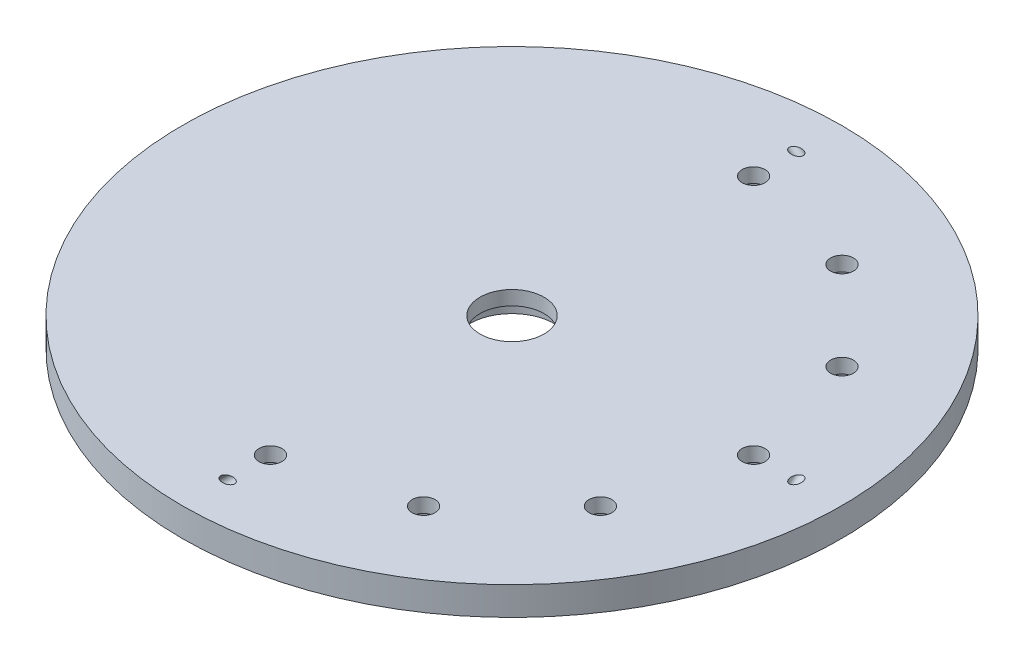
ISO-10303-21;
HEADER;
FILE_DESCRIPTION(('STEP AP214'),'2;1');
FILE_NAME('part.step','',(''),(''),'','','');
FILE_SCHEMA(('AUTOMOTIVE_DESIGN { 1 0 10303 214 1 1 1 1 }'));
ENDSEC;
DATA;
#1=APPLICATION_CONTEXT('core data for automotive mechanical design processes');
#2=APPLICATION_PROTOCOL_DEFINITION('international standard','automotive_design',2000,#1);
#3=PRODUCT_CONTEXT('',#1,'mechanical');
#4=PRODUCT('Part','Part','',(#3));
#5=PRODUCT_RELATED_PRODUCT_CATEGORY('part','',(#4));
#6=PRODUCT_DEFINITION_FORMATION('','',#4);
#7=PRODUCT_DEFINITION_CONTEXT('part definition',#1,'design');
#8=PRODUCT_DEFINITION('design','',#6,#7);
#9=PRODUCT_DEFINITION_SHAPE('','',#8);
#10=(LENGTH_UNIT() NAMED_UNIT(*) SI_UNIT(.MILLI.,.METRE.));
#11=(NAMED_UNIT(*) PLANE_ANGLE_UNIT() SI_UNIT($,.RADIAN.));
#12=(NAMED_UNIT(*) SI_UNIT($,.STERADIAN.) SOLID_ANGLE_UNIT());
#13=UNCERTAINTY_MEASURE_WITH_UNIT(LENGTH_MEASURE(1.E-05),#10,'distance_accuracy_value','');
#14=(GEOMETRIC_REPRESENTATION_CONTEXT(3) GLOBAL_UNCERTAINTY_ASSIGNED_CONTEXT((#13)) GLOBAL_UNIT_ASSIGNED_CONTEXT((#10,
#11,#12)) REPRESENTATION_CONTEXT('',''));
#15=CARTESIAN_POINT('',(0.,0.,0.));
#16=DIRECTION('',(0.,0.,1.));
#17=DIRECTION('',(1.,0.,0.));
#18=AXIS2_PLACEMENT_3D('',#15,#16,#17);
#19=CARTESIAN_POINT('',(0.,0.,0.));
#20=DIRECTION('',(0.,1.,0.));
#21=DIRECTION('',(0.,0.,1.));
#22=AXIS2_PLACEMENT_3D('',#19,#20,#21);
#23=PLANE('',#22);
#24=CARTESIAN_POINT('',(46.7437211692654,0.,-26.9874999999994));
#25=DIRECTION('',(0.,-1.,0.));
#26=DIRECTION('',(0.,0.,-1.));
#27=AXIS2_PLACEMENT_3D('',#24,#25,#26);
#28=CIRCLE('',#27,5.55624999999999);
#29=CARTESIAN_POINT('',(46.7437211692654,0.,-32.5437499999994));
#30=VERTEX_POINT('',#29);
#31=EDGE_CURVE('E600',#30,#30,#28,.T.);
#32=ORIENTED_EDGE('',*,*,#31,.F.);
#33=EDGE_LOOP('',(#32));
#34=FACE_BOUND('',#33,.T.);
#35=CARTESIAN_POINT('',(26.9875000000005,0.,-46.7437211692648));
#36=DIRECTION('',(0.,-1.,0.));
#37=DIRECTION('',(0.,0.,-1.));
#38=AXIS2_PLACEMENT_3D('',#35,#36,#37);
#39=CIRCLE('',#38,5.55625);
#40=CARTESIAN_POINT('',(26.9875000000005,0.,-52.2999711692648));
#41=VERTEX_POINT('',#40);
#42=EDGE_CURVE('E116',#41,#41,#39,.T.);
#43=ORIENTED_EDGE('',*,*,#42,.F.);
#44=EDGE_LOOP('',(#43));
#45=FACE_BOUND('',#44,.T.);
#46=CARTESIAN_POINT('',(-1.88452705264058E-13,0.,53.975));
#47=DIRECTION('',(0.,-1.,0.));
#48=DIRECTION('',(0.,0.,-1.));
#49=AXIS2_PLACEMENT_3D('',#46,#47,#48);
#50=CIRCLE('',#49,5.55625);
#51=CARTESIAN_POINT('',(-1.88452705264058E-13,0.,48.41875));
#52=VERTEX_POINT('',#51);
#53=EDGE_CURVE('E99',#52,#52,#50,.T.);
#54=ORIENTED_EDGE('',*,*,#53,.F.);
#55=EDGE_LOOP('',(#54));
#56=FACE_BOUND('',#55,.T.);
#57=CARTESIAN_POINT('',(26.9874999999999,0.,46.7437211692651));
#58=DIRECTION('',(0.,-1.,0.));
#59=DIRECTION('',(0.,0.,-1.));
#60=AXIS2_PLACEMENT_3D('',#57,#58,#59);
#61=CIRCLE('',#60,5.55625);
#62=CARTESIAN_POINT('',(26.9874999999999,0.,41.1874711692651));
#63=VERTEX_POINT('',#62);
#64=EDGE_CURVE('E95',#63,#63,#61,.T.);
#65=ORIENTED_EDGE('',*,*,#64,.F.);
#66=EDGE_LOOP('',(#65));
#67=FACE_BOUND('',#66,.T.);
#68=CARTESIAN_POINT('',(46.743721169265,0.,26.9875000000001));
#69=DIRECTION('',(0.,-1.,0.));
#70=DIRECTION('',(0.,0.,-1.));
#71=AXIS2_PLACEMENT_3D('',#68,#69,#70);
#72=CIRCLE('',#71,5.55624999999999);
#73=CARTESIAN_POINT('',(46.743721169265,0.,21.4312500000001));
#74=VERTEX_POINT('',#73);
#75=EDGE_CURVE('E90',#74,#74,#72,.T.);
#76=ORIENTED_EDGE('',*,*,#75,.F.);
#77=EDGE_LOOP('',(#76));
#78=FACE_BOUND('',#77,.T.);
#79=CARTESIAN_POINT('',(53.975,0.,0.));
#80=DIRECTION('',(0.,-1.,0.));
#81=DIRECTION('',(0.,0.,-1.));
#82=AXIS2_PLACEMENT_3D('',#79,#80,#81);
#83=CIRCLE('',#82,5.55625);
#84=CARTESIAN_POINT('',(53.975,0.,-5.55625));
#85=VERTEX_POINT('',#84);
#86=EDGE_CURVE('E85',#85,#85,#83,.T.);
#87=ORIENTED_EDGE('',*,*,#86,.F.);
#88=EDGE_LOOP('',(#87));
#89=FACE_BOUND('',#88,.T.);
#90=CARTESIAN_POINT('',(0.,0.,0.));
#91=DIRECTION('',(0.,1.,0.));
#92=DIRECTION('',(0.,0.,1.));
#93=AXIS2_PLACEMENT_3D('',#90,#91,#92);
#94=CIRCLE('',#93,9.525);
#95=CARTESIAN_POINT('',(0.,0.,9.525));
#96=VERTEX_POINT('',#95);
#97=EDGE_CURVE('E80',#96,#96,#94,.T.);
#98=ORIENTED_EDGE('',*,*,#97,.T.);
#99=EDGE_LOOP('',(#98));
#100=FACE_BOUND('',#99,.T.);
#101=CARTESIAN_POINT('',(-7.39566734064749,0.,63.53048));
#102=DIRECTION('',(0.,1.,0.));
#103=DIRECTION('',(-1.,0.,0.));
#104=AXIS2_PLACEMENT_3D('',#101,#102,#103);
#105=ELLIPSE('',#104,3.90248364311136,2.65856713263511);
#106=CARTESIAN_POINT('',(-11.2981509837588,0.,63.53048));
#107=VERTEX_POINT('',#106);
#108=EDGE_CURVE('E70',#107,#107,#105,.T.);
#109=ORIENTED_EDGE('',*,*,#108,.T.);
#110=EDGE_LOOP('',(#109));
#111=FACE_BOUND('',#110,.T.);
#112=CARTESIAN_POINT('',(7.39566734064704,0.,-63.53048));
#113=DIRECTION('',(0.,1.,0.));
#114=DIRECTION('',(1.,0.,0.));
#115=AXIS2_PLACEMENT_3D('',#112,#113,#114);
#116=ELLIPSE('',#115,3.90248364311136,2.65856713263511);
#117=CARTESIAN_POINT('',(11.2981509837584,0.,-63.53048));
#118=VERTEX_POINT('',#117);
#119=EDGE_CURVE('E63',#118,#118,#116,.T.);
#120=ORIENTED_EDGE('',*,*,#119,.T.);
#121=EDGE_LOOP('',(#120));
#122=FACE_BOUND('',#121,.T.);
#123=CARTESIAN_POINT('',(63.53048,0.,7.39566734064726));
#124=DIRECTION('',(0.,1.,0.));
#125=DIRECTION('',(0.,0.,1.));
#126=AXIS2_PLACEMENT_3D('',#123,#124,#125);
#127=ELLIPSE('',#126,3.90248364311136,2.65856713263511);
#128=CARTESIAN_POINT('',(63.53048,0.,11.2981509837586));
#129=VERTEX_POINT('',#128);
#130=EDGE_CURVE('E57',#129,#129,#127,.T.);
#131=ORIENTED_EDGE('',*,*,#130,.T.);
#132=EDGE_LOOP('',(#131));
#133=FACE_BOUND('',#132,.T.);
#134=CARTESIAN_POINT('',(0.,0.,0.));
#135=DIRECTION('',(0.,1.,0.));
#136=DIRECTION('',(0.,0.,1.));
#137=AXIS2_PLACEMENT_3D('',#134,#135,#136);
#138=CIRCLE('',#137,73.63206);
#139=CARTESIAN_POINT('',(0.,0.,73.63206));
#140=VERTEX_POINT('',#139);
#141=EDGE_CURVE('E50',#140,#140,#138,.T.);
#142=ORIENTED_EDGE('',*,*,#141,.F.);
#143=EDGE_LOOP('',(#142));
#144=FACE_BOUND('',#143,.T.);
#145=CARTESIAN_POINT('',(5.65358115792174E-13,0.,-53.975));
#146=DIRECTION('',(0.,-1.,0.));
#147=DIRECTION('',(0.,0.,-1.));
#148=AXIS2_PLACEMENT_3D('',#145,#146,#147);
#149=CIRCLE('',#148,5.55625);
#150=CARTESIAN_POINT('',(5.65358115792174E-13,0.,-59.53125));
#151=VERTEX_POINT('',#150);
#152=EDGE_CURVE('E103',#151,#151,#149,.T.);
#153=ORIENTED_EDGE('',*,*,#152,.F.);
#154=EDGE_LOOP('',(#153));
#155=FACE_BOUND('',#154,.T.);
#156=ADVANCED_FACE('F37',(#34,#45,#56,#67,#78,#89,#100,#111,#122,#133,#144,#155),#23,.F.);
#157=CARTESIAN_POINT('',(0.,6.35,0.));
#158=DIRECTION('',(0.,-1.,0.));
#159=DIRECTION('',(0.,0.,-1.));
#160=AXIS2_PLACEMENT_3D('',#157,#158,#159);
#161=CYLINDRICAL_SURFACE('',#160,73.63206);
#162=CARTESIAN_POINT('',(0.,6.35,0.));
#163=DIRECTION('',(0.,1.,0.));
#164=DIRECTION('',(0.,0.,1.));
#165=AXIS2_PLACEMENT_3D('',#162,#163,#164);
#166=CIRCLE('',#165,73.63206);
#167=CARTESIAN_POINT('',(0.,6.35,73.63206));
#168=VERTEX_POINT('',#167);
#169=EDGE_CURVE('E45',#168,#168,#166,.T.);
#170=ORIENTED_EDGE('',*,*,#169,.F.);
#171=EDGE_LOOP('',(#170));
#172=FACE_BOUND('',#171,.T.);
#173=ORIENTED_EDGE('',*,*,#141,.T.);
#174=EDGE_LOOP('',(#173));
#175=FACE_BOUND('',#174,.T.);
#176=ADVANCED_FACE('F39',(#172,#175),#161,.T.);
#177=CARTESIAN_POINT('',(0.,6.35,0.));
#178=DIRECTION('',(0.,-1.,0.));
#179=DIRECTION('',(0.,0.,-1.));
#180=AXIS2_PLACEMENT_3D('',#177,#178,#179);
#181=CYLINDRICAL_SURFACE('',#180,7.14375);
#182=CARTESIAN_POINT('',(0.,3.175,0.));
#183=DIRECTION('',(0.,1.,0.));
#184=DIRECTION('',(0.,0.,1.));
#185=AXIS2_PLACEMENT_3D('',#182,#183,#184);
#186=CIRCLE('',#185,7.14375);
#187=CARTESIAN_POINT('',(0.,3.175,7.14375));
#188=VERTEX_POINT('',#187);
#189=EDGE_CURVE('E152',#188,#188,#186,.T.);
#190=ORIENTED_EDGE('',*,*,#189,.F.);
#191=EDGE_LOOP('',(#190));
#192=FACE_BOUND('',#191,.T.);
#193=CARTESIAN_POINT('',(0.,6.35,0.));
#194=DIRECTION('',(0.,1.,0.));
#195=DIRECTION('',(0.,0.,1.));
#196=AXIS2_PLACEMENT_3D('',#193,#194,#195);
#197=CIRCLE('',#196,7.14375);
#198=CARTESIAN_POINT('',(0.,6.35,7.14375));
#199=VERTEX_POINT('',#198);
#200=EDGE_CURVE('E10',#199,#199,#197,.T.);
#201=ORIENTED_EDGE('',*,*,#200,.T.);
#202=EDGE_LOOP('',(#201));
#203=FACE_BOUND('',#202,.T.);
#204=ADVANCED_FACE('F190',(#192,#203),#181,.F.);
#205=CARTESIAN_POINT('',(0.,6.35,0.));
#206=DIRECTION('',(0.,1.,0.));
#207=DIRECTION('',(0.,0.,1.));
#208=AXIS2_PLACEMENT_3D('',#205,#206,#207);
#209=PLANE('',#208);
#210=CARTESIAN_POINT('',(46.7437211692654,6.35,-26.9874999999994));
#211=DIRECTION('',(0.,1.,0.));
#212=DIRECTION('',(0.,0.,1.));
#213=AXIS2_PLACEMENT_3D('',#210,#211,#212);
#214=CIRCLE('',#213,2.5527);
#215=CARTESIAN_POINT('',(46.7437211692654,6.35,-24.4347999999994));
#216=VERTEX_POINT('',#215);
#217=EDGE_CURVE('E41',#216,#216,#214,.T.);
#218=ORIENTED_EDGE('',*,*,#217,.F.);
#219=EDGE_LOOP('',(#218));
#220=FACE_BOUND('',#219,.T.);
#221=CARTESIAN_POINT('',(26.9875000000005,6.35,-46.7437211692648));
#222=DIRECTION('',(0.,1.,0.));
#223=DIRECTION('',(0.,0.,1.));
#224=AXIS2_PLACEMENT_3D('',#221,#222,#223);
#225=CIRCLE('',#224,2.5527);
#226=CARTESIAN_POINT('',(26.9875000000005,6.35,-44.1910211692648));
#227=VERTEX_POINT('',#226);
#228=EDGE_CURVE('E101',#227,#227,#225,.T.);
#229=ORIENTED_EDGE('',*,*,#228,.F.);
#230=EDGE_LOOP('',(#229));
#231=FACE_BOUND('',#230,.T.);
#232=CARTESIAN_POINT('',(5.65358115792174E-13,6.35,-53.975));
#233=DIRECTION('',(0.,1.,0.));
#234=DIRECTION('',(0.,0.,1.));
#235=AXIS2_PLACEMENT_3D('',#232,#233,#234);
#236=CIRCLE('',#235,2.5527);
#237=CARTESIAN_POINT('',(5.65358115792174E-13,6.35,-51.4223));
#238=VERTEX_POINT('',#237);
#239=EDGE_CURVE('E97',#238,#238,#236,.T.);
#240=ORIENTED_EDGE('',*,*,#239,.F.);
#241=EDGE_LOOP('',(#240));
#242=FACE_BOUND('',#241,.T.);
#243=CARTESIAN_POINT('',(-1.88452705264058E-13,6.35,53.975));
#244=DIRECTION('',(0.,1.,0.));
#245=DIRECTION('',(0.,0.,1.));
#246=AXIS2_PLACEMENT_3D('',#243,#244,#245);
#247=CIRCLE('',#246,2.5527);
#248=CARTESIAN_POINT('',(-1.88452705264058E-13,6.35,56.5277));
#249=VERTEX_POINT('',#248);
#250=EDGE_CURVE('E92',#249,#249,#247,.T.);
#251=ORIENTED_EDGE('',*,*,#250,.F.);
#252=EDGE_LOOP('',(#251));
#253=FACE_BOUND('',#252,.T.);
#254=CARTESIAN_POINT('',(26.9874999999999,6.35,46.7437211692651));
#255=DIRECTION('',(0.,1.,0.));
#256=DIRECTION('',(0.,0.,1.));
#257=AXIS2_PLACEMENT_3D('',#254,#255,#256);
#258=CIRCLE('',#257,2.5527);
#259=CARTESIAN_POINT('',(26.9874999999999,6.35,49.2964211692651));
#260=VERTEX_POINT('',#259);
#261=EDGE_CURVE('E87',#260,#260,#258,.T.);
#262=ORIENTED_EDGE('',*,*,#261,.F.);
#263=EDGE_LOOP('',(#262));
#264=FACE_BOUND('',#263,.T.);
#265=CARTESIAN_POINT('',(46.743721169265,6.35,26.9875000000001));
#266=DIRECTION('',(0.,1.,0.));
#267=DIRECTION('',(0.,0.,1.));
#268=AXIS2_PLACEMENT_3D('',#265,#266,#267);
#269=CIRCLE('',#268,2.5527);
#270=CARTESIAN_POINT('',(46.743721169265,6.35,29.5402000000001));
#271=VERTEX_POINT('',#270);
#272=EDGE_CURVE('E82',#271,#271,#269,.T.);
#273=ORIENTED_EDGE('',*,*,#272,.F.);
#274=EDGE_LOOP('',(#273));
#275=FACE_BOUND('',#274,.T.);
#276=CARTESIAN_POINT('',(53.975,6.35,0.));
#277=DIRECTION('',(0.,1.,0.));
#278=DIRECTION('',(0.,0.,1.));
#279=AXIS2_PLACEMENT_3D('',#276,#277,#278);
#280=CIRCLE('',#279,2.5527);
#281=CARTESIAN_POINT('',(53.975,6.35,2.5527));
#282=VERTEX_POINT('',#281);
#283=EDGE_CURVE('E77',#282,#282,#280,.T.);
#284=ORIENTED_EDGE('',*,*,#283,.F.);
#285=EDGE_LOOP('',(#284));
#286=FACE_BOUND('',#285,.T.);
#287=CARTESIAN_POINT('',(-2.1163626406917E-13,6.35,63.53048));
#288=DIRECTION('',(0.,1.,0.));
#289=DIRECTION('',(1.,0.,0.));
#290=AXIS2_PLACEMENT_3D('',#287,#288,#289);
#291=ELLIPSE('',#290,1.58052507730817,1.11760000000001);
#292=CARTESIAN_POINT('',(1.58052507730796,6.35,63.53048));
#293=VERTEX_POINT('',#292);
#294=EDGE_CURVE('E73',#293,#293,#291,.T.);
#295=ORIENTED_EDGE('',*,*,#294,.F.);
#296=EDGE_LOOP('',(#295));
#297=FACE_BOUND('',#296,.T.);
#298=CARTESIAN_POINT('',(-2.32452945780892E-13,6.35,-63.53048));
#299=DIRECTION('',(0.,1.,0.));
#300=DIRECTION('',(-1.,0.,0.));
#301=AXIS2_PLACEMENT_3D('',#298,#299,#300);
#302=ELLIPSE('',#301,1.58052507730817,1.11760000000001);
#303=CARTESIAN_POINT('',(-1.5805250773084,6.35,-63.53048));
#304=VERTEX_POINT('',#303);
#305=EDGE_CURVE('E66',#304,#304,#302,.T.);
#306=ORIENTED_EDGE('',*,*,#305,.F.);
#307=EDGE_LOOP('',(#306));
#308=FACE_BOUND('',#307,.T.);
#309=CARTESIAN_POINT('',(63.53048,6.35,0.));
#310=DIRECTION('',(0.,1.,0.));
#311=DIRECTION('',(0.,0.,-1.));
#312=AXIS2_PLACEMENT_3D('',#309,#310,#311);
#313=ELLIPSE('',#312,1.58052507730817,1.11760000000001);
#314=CARTESIAN_POINT('',(63.53048,6.35,-1.58052507730818));
#315=VERTEX_POINT('',#314);
#316=EDGE_CURVE('E56',#315,#315,#313,.T.);
#317=ORIENTED_EDGE('',*,*,#316,.F.);
#318=EDGE_LOOP('',(#317));
#319=FACE_BOUND('',#318,.T.);
#320=ORIENTED_EDGE('',*,*,#169,.T.);
#321=EDGE_LOOP('',(#320));
#322=FACE_BOUND('',#321,.T.);
#323=ORIENTED_EDGE('',*,*,#200,.F.);
#324=EDGE_LOOP('',(#323));
#325=FACE_BOUND('',#324,.T.);
#326=ADVANCED_FACE('F181',(#220,#231,#242,#253,#264,#275,#286,#297,#308,#319,#322,#325),#209,.T.);
#327=CARTESIAN_POINT('',(63.53048,3.80999999999999,2.53999999999997));
#328=DIRECTION('',(0.,-0.707106781186551,0.707106781186544));
#329=DIRECTION('',(0.,-0.707106781186544,-0.707106781186551));
#330=AXIS2_PLACEMENT_3D('',#327,#328,#329);
#331=CONICAL_SURFACE('',#330,1.11760000000001,0.26179938779915);
#332=CARTESIAN_POINT('',(63.53048,3.80999999999999,2.53999999999997));
#333=DIRECTION('',(0.,0.707106781186551,-0.707106781186544));
#334=DIRECTION('',(0.,0.707106781186544,0.707106781186551));
#335=AXIS2_PLACEMENT_3D('',#332,#333,#334);
#336=CIRCLE('',#335,1.11760000000001);
#337=CARTESIAN_POINT('',(63.53048,4.60026253865408,3.33026253865406));
#338=VERTEX_POINT('',#337);
#339=EDGE_CURVE('E60',#338,#338,#336,.T.);
#340=ORIENTED_EDGE('',*,*,#339,.T.);
#341=EDGE_LOOP('',(#340));
#342=FACE_BOUND('',#341,.T.);
#343=ORIENTED_EDGE('',*,*,#130,.F.);
#344=EDGE_LOOP('',(#343));
#345=FACE_BOUND('',#344,.T.);
#346=ADVANCED_FACE('F166',(#342,#345),#331,.F.);
#347=CARTESIAN_POINT('',(63.53048,24.3105122421384,-17.9605122421382));
#348=DIRECTION('',(0.,0.707106781186551,-0.707106781186544));
#349=DIRECTION('',(0.,0.707106781186544,0.707106781186551));
#350=AXIS2_PLACEMENT_3D('',#347,#348,#349);
#351=CYLINDRICAL_SURFACE('',#350,1.11760000000001);
#352=ORIENTED_EDGE('',*,*,#316,.T.);
#353=EDGE_LOOP('',(#352));
#354=FACE_BOUND('',#353,.T.);
#355=ORIENTED_EDGE('',*,*,#339,.F.);
#356=EDGE_LOOP('',(#355));
#357=FACE_BOUND('',#356,.T.);
#358=ADVANCED_FACE('F169',(#354,#357),#351,.F.);
#359=CARTESIAN_POINT('',(2.53999999999974,3.80999999999999,-63.53048));
#360=DIRECTION('',(0.707106781186544,-0.707106781186551,0.));
#361=DIRECTION('',(-0.707106781186551,-0.707106781186544,0.));
#362=AXIS2_PLACEMENT_3D('',#359,#360,#361);
#363=CONICAL_SURFACE('',#362,1.11760000000001,0.26179938779915);
#364=CARTESIAN_POINT('',(2.53999999999974,3.80999999999999,-63.53048));
#365=DIRECTION('',(-0.707106781186544,0.707106781186551,0.));
#366=DIRECTION('',(0.707106781186551,0.707106781186544,0.));
#367=AXIS2_PLACEMENT_3D('',#364,#365,#366);
#368=CIRCLE('',#367,1.11760000000001);
#369=CARTESIAN_POINT('',(3.33026253865384,4.60026253865408,-63.53048));
#370=VERTEX_POINT('',#369);
#371=EDGE_CURVE('E67',#370,#370,#368,.T.);
#372=ORIENTED_EDGE('',*,*,#371,.T.);
#373=EDGE_LOOP('',(#372));
#374=FACE_BOUND('',#373,.T.);
#375=ORIENTED_EDGE('',*,*,#119,.F.);
#376=EDGE_LOOP('',(#375));
#377=FACE_BOUND('',#376,.T.);
#378=ADVANCED_FACE('F171',(#374,#377),#363,.F.);
#379=CARTESIAN_POINT('',(-17.9605122421384,24.3105122421384,-63.5304799999999));
#380=DIRECTION('',(-0.707106781186544,0.707106781186551,0.));
#381=DIRECTION('',(0.707106781186551,0.707106781186544,0.));
#382=AXIS2_PLACEMENT_3D('',#379,#380,#381);
#383=CYLINDRICAL_SURFACE('',#382,1.11760000000001);
#384=ORIENTED_EDGE('',*,*,#305,.T.);
#385=EDGE_LOOP('',(#384));
#386=FACE_BOUND('',#385,.T.);
#387=ORIENTED_EDGE('',*,*,#371,.F.);
#388=EDGE_LOOP('',(#387));
#389=FACE_BOUND('',#388,.T.);
#390=ADVANCED_FACE('F178',(#386,#389),#383,.F.);
#391=CARTESIAN_POINT('',(-2.54000000000019,3.80999999999999,63.53048));
#392=DIRECTION('',(-0.707106781186544,-0.707106781186551,0.));
#393=DIRECTION('',(0.707106781186551,-0.707106781186544,0.));
#394=AXIS2_PLACEMENT_3D('',#391,#392,#393);
#395=CONICAL_SURFACE('',#394,1.11760000000001,0.26179938779915);
#396=CARTESIAN_POINT('',(-2.54000000000019,3.80999999999999,63.53048));
#397=DIRECTION('',(0.707106781186544,0.707106781186551,0.));
#398=DIRECTION('',(-0.707106781186551,0.707106781186544,0.));
#399=AXIS2_PLACEMENT_3D('',#396,#397,#398);
#400=CIRCLE('',#399,1.11760000000001);
#401=CARTESIAN_POINT('',(-3.33026253865428,4.60026253865408,63.53048));
#402=VERTEX_POINT('',#401);
#403=EDGE_CURVE('E74',#402,#402,#400,.T.);
#404=ORIENTED_EDGE('',*,*,#403,.T.);
#405=EDGE_LOOP('',(#404));
#406=FACE_BOUND('',#405,.T.);
#407=ORIENTED_EDGE('',*,*,#108,.F.);
#408=EDGE_LOOP('',(#407));
#409=FACE_BOUND('',#408,.T.);
#410=ADVANCED_FACE('F295',(#406,#409),#395,.F.);
#411=CARTESIAN_POINT('',(17.960512242138,24.3105122421384,63.5304800000001));
#412=DIRECTION('',(0.707106781186544,0.707106781186551,0.));
#413=DIRECTION('',(-0.707106781186551,0.707106781186544,0.));
#414=AXIS2_PLACEMENT_3D('',#411,#412,#413);
#415=CYLINDRICAL_SURFACE('',#414,1.11760000000001);
#416=ORIENTED_EDGE('',*,*,#294,.T.);
#417=EDGE_LOOP('',(#416));
#418=FACE_BOUND('',#417,.T.);
#419=ORIENTED_EDGE('',*,*,#403,.F.);
#420=EDGE_LOOP('',(#419));
#421=FACE_BOUND('',#420,.T.);
#422=ADVANCED_FACE('F212',(#418,#421),#415,.F.);
#423=CARTESIAN_POINT('',(0.,3.175,0.));
#424=DIRECTION('',(0.,-1.,0.));
#425=DIRECTION('',(0.,0.,-1.));
#426=AXIS2_PLACEMENT_3D('',#423,#424,#425);
#427=CYLINDRICAL_SURFACE('',#426,9.525);
#428=CARTESIAN_POINT('',(0.,3.175,0.));
#429=DIRECTION('',(0.,1.,0.));
#430=DIRECTION('',(0.,0.,1.));
#431=AXIS2_PLACEMENT_3D('',#428,#429,#430);
#432=CIRCLE('',#431,9.525);
#433=CARTESIAN_POINT('',(0.,3.175,9.525));
#434=VERTEX_POINT('',#433);
#435=EDGE_CURVE('E155',#434,#434,#432,.T.);
#436=ORIENTED_EDGE('',*,*,#435,.T.);
#437=EDGE_LOOP('',(#436));
#438=FACE_BOUND('',#437,.T.);
#439=ORIENTED_EDGE('',*,*,#97,.F.);
#440=EDGE_LOOP('',(#439));
#441=FACE_BOUND('',#440,.T.);
#442=ADVANCED_FACE('F206',(#438,#441),#427,.F.);
#443=CARTESIAN_POINT('',(0.,3.175,0.));
#444=DIRECTION('',(0.,1.,0.));
#445=DIRECTION('',(0.,0.,1.));
#446=AXIS2_PLACEMENT_3D('',#443,#444,#445);
#447=PLANE('',#446);
#448=ORIENTED_EDGE('',*,*,#189,.T.);
#449=EDGE_LOOP('',(#448));
#450=FACE_BOUND('',#449,.T.);
#451=ORIENTED_EDGE('',*,*,#435,.F.);
#452=EDGE_LOOP('',(#451));
#453=FACE_BOUND('',#452,.T.);
#454=ADVANCED_FACE('F202',(#450,#453),#447,.F.);
#455=CARTESIAN_POINT('',(53.975,0.,0.));
#456=DIRECTION('',(0.,-1.,0.));
#457=DIRECTION('',(0.,0.,-1.));
#458=AXIS2_PLACEMENT_3D('',#455,#456,#457);
#459=CYLINDRICAL_SURFACE('',#458,2.5527);
#460=ORIENTED_EDGE('',*,*,#283,.T.);
#461=EDGE_LOOP('',(#460));
#462=FACE_BOUND('',#461,.T.);
#463=CARTESIAN_POINT('',(53.975,3.1242,0.));
#464=DIRECTION('',(0.,-1.,0.));
#465=DIRECTION('',(0.,0.,-1.));
#466=AXIS2_PLACEMENT_3D('',#463,#464,#465);
#467=CIRCLE('',#466,2.5527);
#468=CARTESIAN_POINT('',(53.975,3.1242,-2.5527));
#469=VERTEX_POINT('',#468);
#470=EDGE_CURVE('E81',#469,#469,#467,.T.);
#471=ORIENTED_EDGE('',*,*,#470,.T.);
#472=EDGE_LOOP('',(#471));
#473=FACE_BOUND('',#472,.T.);
#474=ADVANCED_FACE('F205',(#462,#473),#459,.F.);
#475=CARTESIAN_POINT('',(56.5277,3.1242,0.));
#476=DIRECTION('',(0.,1.,0.));
#477=DIRECTION('',(0.,0.,1.));
#478=AXIS2_PLACEMENT_3D('',#475,#476,#477);
#479=PLANE('',#478);
#480=ORIENTED_EDGE('',*,*,#470,.F.);
#481=EDGE_LOOP('',(#480));
#482=FACE_BOUND('',#481,.T.);
#483=CARTESIAN_POINT('',(53.975,3.1242,0.));
#484=DIRECTION('',(0.,-1.,0.));
#485=DIRECTION('',(0.,0.,-1.));
#486=AXIS2_PLACEMENT_3D('',#483,#484,#485);
#487=CIRCLE('',#486,5.55625);
#488=CARTESIAN_POINT('',(53.975,3.1242,-5.55625));
#489=VERTEX_POINT('',#488);
#490=EDGE_CURVE('E147',#489,#489,#487,.T.);
#491=ORIENTED_EDGE('',*,*,#490,.T.);
#492=EDGE_LOOP('',(#491));
#493=FACE_BOUND('',#492,.T.);
#494=ADVANCED_FACE('F287',(#482,#493),#479,.F.);
#495=CARTESIAN_POINT('',(53.975,0.,0.));
#496=DIRECTION('',(0.,-1.,0.));
#497=DIRECTION('',(0.,0.,-1.));
#498=AXIS2_PLACEMENT_3D('',#495,#496,#497);
#499=CYLINDRICAL_SURFACE('',#498,5.55625);
#500=ORIENTED_EDGE('',*,*,#490,.F.);
#501=EDGE_LOOP('',(#500));
#502=FACE_BOUND('',#501,.T.);
#503=ORIENTED_EDGE('',*,*,#86,.T.);
#504=EDGE_LOOP('',(#503));
#505=FACE_BOUND('',#504,.T.);
#506=ADVANCED_FACE('F283',(#502,#505),#499,.F.);
#507=CARTESIAN_POINT('',(46.743721169265,0.,26.9875000000001));
#508=DIRECTION('',(0.,-1.,0.));
#509=DIRECTION('',(0.,0.,-1.));
#510=AXIS2_PLACEMENT_3D('',#507,#508,#509);
#511=CYLINDRICAL_SURFACE('',#510,2.5527);
#512=ORIENTED_EDGE('',*,*,#272,.T.);
#513=EDGE_LOOP('',(#512));
#514=FACE_BOUND('',#513,.T.);
#515=CARTESIAN_POINT('',(46.743721169265,3.1242,26.9875000000001));
#516=DIRECTION('',(0.,-1.,0.));
#517=DIRECTION('',(0.,0.,-1.));
#518=AXIS2_PLACEMENT_3D('',#515,#516,#517);
#519=CIRCLE('',#518,2.5527);
#520=CARTESIAN_POINT('',(46.743721169265,3.1242,24.4348000000001));
#521=VERTEX_POINT('',#520);
#522=EDGE_CURVE('E86',#521,#521,#519,.T.);
#523=ORIENTED_EDGE('',*,*,#522,.T.);
#524=EDGE_LOOP('',(#523));
#525=FACE_BOUND('',#524,.T.);
#526=ADVANCED_FACE('F279',(#514,#525),#511,.F.);
#527=CARTESIAN_POINT('',(49.296421169265,3.1242,26.9875000000001));
#528=DIRECTION('',(0.,1.,0.));
#529=DIRECTION('',(0.,0.,1.));
#530=AXIS2_PLACEMENT_3D('',#527,#528,#529);
#531=PLANE('',#530);
#532=ORIENTED_EDGE('',*,*,#522,.F.);
#533=EDGE_LOOP('',(#532));
#534=FACE_BOUND('',#533,.T.);
#535=CARTESIAN_POINT('',(46.743721169265,3.1242,26.9875000000001));
#536=DIRECTION('',(0.,-1.,0.));
#537=DIRECTION('',(0.,0.,-1.));
#538=AXIS2_PLACEMENT_3D('',#535,#536,#537);
#539=CIRCLE('',#538,5.55625);
#540=CARTESIAN_POINT('',(46.743721169265,3.1242,21.4312500000001));
#541=VERTEX_POINT('',#540);
#542=EDGE_CURVE('E140',#541,#541,#539,.T.);
#543=ORIENTED_EDGE('',*,*,#542,.T.);
#544=EDGE_LOOP('',(#543));
#545=FACE_BOUND('',#544,.T.);
#546=ADVANCED_FACE('F275',(#534,#545),#531,.F.);
#547=CARTESIAN_POINT('',(46.743721169265,0.,26.9875000000001));
#548=DIRECTION('',(0.,-1.,0.));
#549=DIRECTION('',(0.,0.,-1.));
#550=AXIS2_PLACEMENT_3D('',#547,#548,#549);
#551=CYLINDRICAL_SURFACE('',#550,5.55625);
#552=ORIENTED_EDGE('',*,*,#542,.F.);
#553=EDGE_LOOP('',(#552));
#554=FACE_BOUND('',#553,.T.);
#555=ORIENTED_EDGE('',*,*,#75,.T.);
#556=EDGE_LOOP('',(#555));
#557=FACE_BOUND('',#556,.T.);
#558=ADVANCED_FACE('F271',(#554,#557),#551,.F.);
#559=CARTESIAN_POINT('',(26.9874999999999,0.,46.7437211692651));
#560=DIRECTION('',(0.,-1.,0.));
#561=DIRECTION('',(0.,0.,-1.));
#562=AXIS2_PLACEMENT_3D('',#559,#560,#561);
#563=CYLINDRICAL_SURFACE('',#562,2.5527);
#564=ORIENTED_EDGE('',*,*,#261,.T.);
#565=EDGE_LOOP('',(#564));
#566=FACE_BOUND('',#565,.T.);
#567=CARTESIAN_POINT('',(26.9874999999999,3.1242,46.7437211692651));
#568=DIRECTION('',(0.,-1.,0.));
#569=DIRECTION('',(0.,0.,-1.));
#570=AXIS2_PLACEMENT_3D('',#567,#568,#569);
#571=CIRCLE('',#570,2.5527);
#572=CARTESIAN_POINT('',(26.9874999999999,3.1242,44.1910211692651));
#573=VERTEX_POINT('',#572);
#574=EDGE_CURVE('E91',#573,#573,#571,.T.);
#575=ORIENTED_EDGE('',*,*,#574,.T.);
#576=EDGE_LOOP('',(#575));
#577=FACE_BOUND('',#576,.T.);
#578=ADVANCED_FACE('F267',(#566,#577),#563,.F.);
#579=CARTESIAN_POINT('',(29.5401999999999,3.1242,46.7437211692651));
#580=DIRECTION('',(0.,1.,0.));
#581=DIRECTION('',(0.,0.,1.));
#582=AXIS2_PLACEMENT_3D('',#579,#580,#581);
#583=PLANE('',#582);
#584=ORIENTED_EDGE('',*,*,#574,.F.);
#585=EDGE_LOOP('',(#584));
#586=FACE_BOUND('',#585,.T.);
#587=CARTESIAN_POINT('',(26.9874999999999,3.1242,46.7437211692651));
#588=DIRECTION('',(0.,-1.,0.));
#589=DIRECTION('',(0.,0.,-1.));
#590=AXIS2_PLACEMENT_3D('',#587,#588,#589);
#591=CIRCLE('',#590,5.55625);
#592=CARTESIAN_POINT('',(26.9874999999999,3.1242,41.1874711692651));
#593=VERTEX_POINT('',#592);
#594=EDGE_CURVE('E133',#593,#593,#591,.T.);
#595=ORIENTED_EDGE('',*,*,#594,.T.);
#596=EDGE_LOOP('',(#595));
#597=FACE_BOUND('',#596,.T.);
#598=ADVANCED_FACE('F263',(#586,#597),#583,.F.);
#599=CARTESIAN_POINT('',(26.9874999999999,0.,46.7437211692651));
#600=DIRECTION('',(0.,-1.,0.));
#601=DIRECTION('',(0.,0.,-1.));
#602=AXIS2_PLACEMENT_3D('',#599,#600,#601);
#603=CYLINDRICAL_SURFACE('',#602,5.55625);
#604=ORIENTED_EDGE('',*,*,#594,.F.);
#605=EDGE_LOOP('',(#604));
#606=FACE_BOUND('',#605,.T.);
#607=ORIENTED_EDGE('',*,*,#64,.T.);
#608=EDGE_LOOP('',(#607));
#609=FACE_BOUND('',#608,.T.);
#610=ADVANCED_FACE('F259',(#606,#609),#603,.F.);
#611=CARTESIAN_POINT('',(-1.88452705264058E-13,0.,53.975));
#612=DIRECTION('',(0.,-1.,0.));
#613=DIRECTION('',(0.,0.,-1.));
#614=AXIS2_PLACEMENT_3D('',#611,#612,#613);
#615=CYLINDRICAL_SURFACE('',#614,2.5527);
#616=ORIENTED_EDGE('',*,*,#250,.T.);
#617=EDGE_LOOP('',(#616));
#618=FACE_BOUND('',#617,.T.);
#619=CARTESIAN_POINT('',(-1.88452705264058E-13,3.1242,53.975));
#620=DIRECTION('',(0.,-1.,0.));
#621=DIRECTION('',(0.,0.,-1.));
#622=AXIS2_PLACEMENT_3D('',#619,#620,#621);
#623=CIRCLE('',#622,2.5527);
#624=CARTESIAN_POINT('',(-1.88452705264058E-13,3.1242,51.4223));
#625=VERTEX_POINT('',#624);
#626=EDGE_CURVE('E96',#625,#625,#623,.T.);
#627=ORIENTED_EDGE('',*,*,#626,.T.);
#628=EDGE_LOOP('',(#627));
#629=FACE_BOUND('',#628,.T.);
#630=ADVANCED_FACE('F255',(#618,#629),#615,.F.);
#631=CARTESIAN_POINT('',(2.55269999999981,3.1242,53.975));
#632=DIRECTION('',(0.,1.,0.));
#633=DIRECTION('',(0.,0.,1.));
#634=AXIS2_PLACEMENT_3D('',#631,#632,#633);
#635=PLANE('',#634);
#636=ORIENTED_EDGE('',*,*,#626,.F.);
#637=EDGE_LOOP('',(#636));
#638=FACE_BOUND('',#637,.T.);
#639=CARTESIAN_POINT('',(-1.88452705264058E-13,3.1242,53.975));
#640=DIRECTION('',(0.,-1.,0.));
#641=DIRECTION('',(0.,0.,-1.));
#642=AXIS2_PLACEMENT_3D('',#639,#640,#641);
#643=CIRCLE('',#642,5.55625);
#644=CARTESIAN_POINT('',(-1.88452705264058E-13,3.1242,48.41875));
#645=VERTEX_POINT('',#644);
#646=EDGE_CURVE('E126',#645,#645,#643,.T.);
#647=ORIENTED_EDGE('',*,*,#646,.T.);
#648=EDGE_LOOP('',(#647));
#649=FACE_BOUND('',#648,.T.);
#650=ADVANCED_FACE('F251',(#638,#649),#635,.F.);
#651=CARTESIAN_POINT('',(-1.88452705264058E-13,0.,53.975));
#652=DIRECTION('',(0.,-1.,0.));
#653=DIRECTION('',(0.,0.,-1.));
#654=AXIS2_PLACEMENT_3D('',#651,#652,#653);
#655=CYLINDRICAL_SURFACE('',#654,5.55625);
#656=ORIENTED_EDGE('',*,*,#646,.F.);
#657=EDGE_LOOP('',(#656));
#658=FACE_BOUND('',#657,.T.);
#659=ORIENTED_EDGE('',*,*,#53,.T.);
#660=EDGE_LOOP('',(#659));
#661=FACE_BOUND('',#660,.T.);
#662=ADVANCED_FACE('F247',(#658,#661),#655,.F.);
#663=CARTESIAN_POINT('',(5.65358115792174E-13,0.,-53.975));
#664=DIRECTION('',(0.,-1.,0.));
#665=DIRECTION('',(0.,0.,-1.));
#666=AXIS2_PLACEMENT_3D('',#663,#664,#665);
#667=CYLINDRICAL_SURFACE('',#666,2.5527);
#668=ORIENTED_EDGE('',*,*,#239,.T.);
#669=EDGE_LOOP('',(#668));
#670=FACE_BOUND('',#669,.T.);
#671=CARTESIAN_POINT('',(5.65358115792174E-13,3.1242,-53.975));
#672=DIRECTION('',(0.,-1.,0.));
#673=DIRECTION('',(0.,0.,-1.));
#674=AXIS2_PLACEMENT_3D('',#671,#672,#673);
#675=CIRCLE('',#674,2.5527);
#676=CARTESIAN_POINT('',(5.65358115792174E-13,3.1242,-56.5277));
#677=VERTEX_POINT('',#676);
#678=EDGE_CURVE('E100',#677,#677,#675,.T.);
#679=ORIENTED_EDGE('',*,*,#678,.T.);
#680=EDGE_LOOP('',(#679));
#681=FACE_BOUND('',#680,.T.);
#682=ADVANCED_FACE('F239',(#670,#681),#667,.F.);
#683=CARTESIAN_POINT('',(2.55270000000056,3.1242,-53.975));
#684=DIRECTION('',(0.,1.,0.));
#685=DIRECTION('',(0.,0.,1.));
#686=AXIS2_PLACEMENT_3D('',#683,#684,#685);
#687=PLANE('',#686);
#688=ORIENTED_EDGE('',*,*,#678,.F.);
#689=EDGE_LOOP('',(#688));
#690=FACE_BOUND('',#689,.T.);
#691=CARTESIAN_POINT('',(5.65358115792174E-13,3.1242,-53.975));
#692=DIRECTION('',(0.,-1.,0.));
#693=DIRECTION('',(0.,0.,-1.));
#694=AXIS2_PLACEMENT_3D('',#691,#692,#693);
#695=CIRCLE('',#694,5.55625);
#696=CARTESIAN_POINT('',(5.65358115792174E-13,3.1242,-59.53125));
#697=VERTEX_POINT('',#696);
#698=EDGE_CURVE('E108',#697,#697,#695,.T.);
#699=ORIENTED_EDGE('',*,*,#698,.T.);
#700=EDGE_LOOP('',(#699));
#701=FACE_BOUND('',#700,.T.);
#702=ADVANCED_FACE('F230',(#690,#701),#687,.F.);
#703=CARTESIAN_POINT('',(5.65358115792174E-13,0.,-53.975));
#704=DIRECTION('',(0.,-1.,0.));
#705=DIRECTION('',(0.,0.,-1.));
#706=AXIS2_PLACEMENT_3D('',#703,#704,#705);
#707=CYLINDRICAL_SURFACE('',#706,5.55625);
#708=ORIENTED_EDGE('',*,*,#698,.F.);
#709=EDGE_LOOP('',(#708));
#710=FACE_BOUND('',#709,.T.);
#711=ORIENTED_EDGE('',*,*,#152,.T.);
#712=EDGE_LOOP('',(#711));
#713=FACE_BOUND('',#712,.T.);
#714=ADVANCED_FACE('F227',(#710,#713),#707,.F.);
#715=CARTESIAN_POINT('',(26.9875000000005,0.,-46.7437211692648));
#716=DIRECTION('',(0.,-1.,0.));
#717=DIRECTION('',(0.,0.,-1.));
#718=AXIS2_PLACEMENT_3D('',#715,#716,#717);
#719=CYLINDRICAL_SURFACE('',#718,2.5527);
#720=ORIENTED_EDGE('',*,*,#228,.T.);
#721=EDGE_LOOP('',(#720));
#722=FACE_BOUND('',#721,.T.);
#723=CARTESIAN_POINT('',(26.9875000000005,3.1242,-46.7437211692648));
#724=DIRECTION('',(0.,-1.,0.));
#725=DIRECTION('',(0.,0.,-1.));
#726=AXIS2_PLACEMENT_3D('',#723,#724,#725);
#727=CIRCLE('',#726,2.5527);
#728=CARTESIAN_POINT('',(26.9875000000005,3.1242,-49.2964211692648));
#729=VERTEX_POINT('',#728);
#730=EDGE_CURVE('E104',#729,#729,#727,.T.);
#731=ORIENTED_EDGE('',*,*,#730,.T.);
#732=EDGE_LOOP('',(#731));
#733=FACE_BOUND('',#732,.T.);
#734=ADVANCED_FACE('F229',(#722,#733),#719,.F.);
#735=CARTESIAN_POINT('',(29.5402000000005,3.1242,-46.7437211692648));
#736=DIRECTION('',(0.,1.,0.));
#737=DIRECTION('',(0.,0.,1.));
#738=AXIS2_PLACEMENT_3D('',#735,#736,#737);
#739=PLANE('',#738);
#740=ORIENTED_EDGE('',*,*,#730,.F.);
#741=EDGE_LOOP('',(#740));
#742=FACE_BOUND('',#741,.T.);
#743=CARTESIAN_POINT('',(26.9875000000005,3.1242,-46.7437211692648));
#744=DIRECTION('',(0.,-1.,0.));
#745=DIRECTION('',(0.,0.,-1.));
#746=AXIS2_PLACEMENT_3D('',#743,#744,#745);
#747=CIRCLE('',#746,5.55625);
#748=CARTESIAN_POINT('',(26.9875000000005,3.1242,-52.2999711692648));
#749=VERTEX_POINT('',#748);
#750=EDGE_CURVE('E111',#749,#749,#747,.T.);
#751=ORIENTED_EDGE('',*,*,#750,.T.);
#752=EDGE_LOOP('',(#751));
#753=FACE_BOUND('',#752,.T.);
#754=ADVANCED_FACE('F237',(#742,#753),#739,.F.);
#755=CARTESIAN_POINT('',(26.9875000000005,0.,-46.7437211692648));
#756=DIRECTION('',(0.,-1.,0.));
#757=DIRECTION('',(0.,0.,-1.));
#758=AXIS2_PLACEMENT_3D('',#755,#756,#757);
#759=CYLINDRICAL_SURFACE('',#758,5.55625);
#760=ORIENTED_EDGE('',*,*,#750,.F.);
#761=EDGE_LOOP('',(#760));
#762=FACE_BOUND('',#761,.T.);
#763=ORIENTED_EDGE('',*,*,#42,.T.);
#764=EDGE_LOOP('',(#763));
#765=FACE_BOUND('',#764,.T.);
#766=ADVANCED_FACE('F414',(#762,#765),#759,.F.);
#767=CARTESIAN_POINT('',(46.7437211692654,0.,-26.9874999999994));
#768=DIRECTION('',(0.,-1.,0.));
#769=DIRECTION('',(0.,0.,-1.));
#770=AXIS2_PLACEMENT_3D('',#767,#768,#769);
#771=CYLINDRICAL_SURFACE('',#770,2.5527);
#772=ORIENTED_EDGE('',*,*,#217,.T.);
#773=EDGE_LOOP('',(#772));
#774=FACE_BOUND('',#773,.T.);
#775=CARTESIAN_POINT('',(46.7437211692654,3.1242,-26.9874999999994));
#776=DIRECTION('',(0.,-1.,0.));
#777=DIRECTION('',(0.,0.,-1.));
#778=AXIS2_PLACEMENT_3D('',#775,#776,#777);
#779=CIRCLE('',#778,2.5527);
#780=CARTESIAN_POINT('',(46.7437211692654,3.1242,-29.5401999999994));
#781=VERTEX_POINT('',#780);
#782=EDGE_CURVE('E602',#781,#781,#779,.T.);
#783=ORIENTED_EDGE('',*,*,#782,.T.);
#784=EDGE_LOOP('',(#783));
#785=FACE_BOUND('',#784,.T.);
#786=ADVANCED_FACE('F424',(#774,#785),#771,.F.);
#787=CARTESIAN_POINT('',(49.2964211692654,3.1242,-26.9874999999994));
#788=DIRECTION('',(0.,1.,0.));
#789=DIRECTION('',(0.,0.,1.));
#790=AXIS2_PLACEMENT_3D('',#787,#788,#789);
#791=PLANE('',#790);
#792=ORIENTED_EDGE('',*,*,#782,.F.);
#793=EDGE_LOOP('',(#792));
#794=FACE_BOUND('',#793,.T.);
#795=CARTESIAN_POINT('',(46.7437211692654,3.1242,-26.9874999999994));
#796=DIRECTION('',(0.,-1.,0.));
#797=DIRECTION('',(0.,0.,-1.));
#798=AXIS2_PLACEMENT_3D('',#795,#796,#797);
#799=CIRCLE('',#798,5.55625);
#800=CARTESIAN_POINT('',(46.7437211692654,3.1242,-32.5437499999994));
#801=VERTEX_POINT('',#800);
#802=EDGE_CURVE('E598',#801,#801,#799,.T.);
#803=ORIENTED_EDGE('',*,*,#802,.T.);
#804=EDGE_LOOP('',(#803));
#805=FACE_BOUND('',#804,.T.);
#806=ADVANCED_FACE('F435',(#794,#805),#791,.F.);
#807=CARTESIAN_POINT('',(46.7437211692654,0.,-26.9874999999994));
#808=DIRECTION('',(0.,-1.,0.));
#809=DIRECTION('',(0.,0.,-1.));
#810=AXIS2_PLACEMENT_3D('',#807,#808,#809);
#811=CYLINDRICAL_SURFACE('',#810,5.55625);
#812=ORIENTED_EDGE('',*,*,#802,.F.);
#813=EDGE_LOOP('',(#812));
#814=FACE_BOUND('',#813,.T.);
#815=ORIENTED_EDGE('',*,*,#31,.T.);
#816=EDGE_LOOP('',(#815));
#817=FACE_BOUND('',#816,.T.);
#818=ADVANCED_FACE('F446',(#814,#817),#811,.F.);
#819=CLOSED_SHELL('',(#156,#176,#204,#326,#346,#358,#378,#390,#410,#422,#442,#454,#474,#494,
#506,#526,#546,#558,#578,#598,#610,#630,#650,#662,#682,#702,#714,#734,#754,#766,#786,#806,#818));
#820=MANIFOLD_SOLID_BREP('B2',#819);
#821=ADVANCED_BREP_SHAPE_REPRESENTATION('',(#18,#820),#14);
#822=SHAPE_DEFINITION_REPRESENTATION(#9,#821);
ENDSEC;
END-ISO-10303-21;
